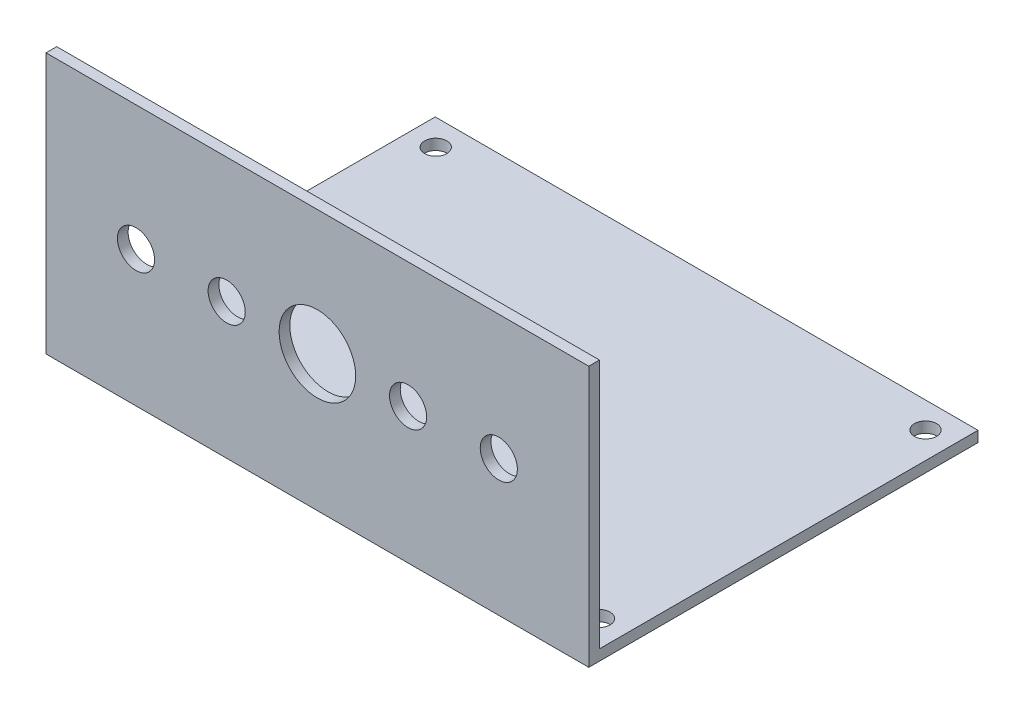
ISO-10303-21;
HEADER;
FILE_DESCRIPTION(('STEP AP214'),'2;1');
FILE_NAME('part.step','',(''),(''),'','','');
FILE_SCHEMA(('AUTOMOTIVE_DESIGN { 1 0 10303 214 1 1 1 1 }'));
ENDSEC;
DATA;
#1=APPLICATION_CONTEXT('core data for automotive mechanical design processes');
#2=APPLICATION_PROTOCOL_DEFINITION('international standard','automotive_design',2000,#1);
#3=PRODUCT_CONTEXT('',#1,'mechanical');
#4=PRODUCT('Part','Part','',(#3));
#5=PRODUCT_RELATED_PRODUCT_CATEGORY('part','',(#4));
#6=PRODUCT_DEFINITION_FORMATION('','',#4);
#7=PRODUCT_DEFINITION_CONTEXT('part definition',#1,'design');
#8=PRODUCT_DEFINITION('design','',#6,#7);
#9=PRODUCT_DEFINITION_SHAPE('','',#8);
#10=(LENGTH_UNIT() NAMED_UNIT(*) SI_UNIT(.MILLI.,.METRE.));
#11=(NAMED_UNIT(*) PLANE_ANGLE_UNIT() SI_UNIT($,.RADIAN.));
#12=(NAMED_UNIT(*) SI_UNIT($,.STERADIAN.) SOLID_ANGLE_UNIT());
#13=UNCERTAINTY_MEASURE_WITH_UNIT(LENGTH_MEASURE(1.E-05),#10,'distance_accuracy_value','');
#14=(GEOMETRIC_REPRESENTATION_CONTEXT(3) GLOBAL_UNCERTAINTY_ASSIGNED_CONTEXT((#13)) GLOBAL_UNIT_ASSIGNED_CONTEXT((#10,
#11,#12)) REPRESENTATION_CONTEXT('',''));
#15=CARTESIAN_POINT('',(0.,0.,0.));
#16=DIRECTION('',(0.,0.,1.));
#17=DIRECTION('',(1.,0.,0.));
#18=AXIS2_PLACEMENT_3D('',#15,#16,#17);
#19=CARTESIAN_POINT('',(0.,1.5,0.));
#20=DIRECTION('',(0.,1.,0.));
#21=DIRECTION('',(0.,0.,1.));
#22=AXIS2_PLACEMENT_3D('',#19,#20,#21);
#23=PLANE('',#22);
#24=DIRECTION('',(-1.,0.,0.));
#25=VECTOR('',#24,1.);
#26=CARTESIAN_POINT('',(-38.,1.5,26.5));
#27=LINE('',#26,#25);
#28=CARTESIAN_POINT('',(38.,1.5,26.5));
#29=VERTEX_POINT('',#28);
#30=CARTESIAN_POINT('',(-38.,1.5,26.5));
#31=VERTEX_POINT('',#30);
#32=EDGE_CURVE('E49',#29,#31,#27,.T.);
#33=ORIENTED_EDGE('',*,*,#32,.F.);
#34=DIRECTION('',(0.,0.,-1.));
#35=VECTOR('',#34,1.);
#36=CARTESIAN_POINT('',(38.,1.5,26.5));
#37=LINE('',#36,#35);
#38=CARTESIAN_POINT('',(38.,1.5,-26.5));
#39=VERTEX_POINT('',#38);
#40=EDGE_CURVE('E98',#29,#39,#37,.T.);
#41=ORIENTED_EDGE('',*,*,#40,.T.);
#42=DIRECTION('',(-1.,0.,0.));
#43=VECTOR('',#42,1.);
#44=CARTESIAN_POINT('',(38.,1.5,-26.5));
#45=LINE('',#44,#43);
#46=CARTESIAN_POINT('',(-38.,1.5,-26.5));
#47=VERTEX_POINT('',#46);
#48=EDGE_CURVE('E55',#39,#47,#45,.T.);
#49=ORIENTED_EDGE('',*,*,#48,.T.);
#50=DIRECTION('',(0.,0.,1.));
#51=VECTOR('',#50,1.);
#52=CARTESIAN_POINT('',(-38.,1.5,26.5));
#53=LINE('',#52,#51);
#54=EDGE_CURVE('E75',#47,#31,#53,.T.);
#55=ORIENTED_EDGE('',*,*,#54,.T.);
#56=EDGE_LOOP('',(#33,#41,#49,#55));
#57=FACE_BOUND('',#56,.T.);
#58=CARTESIAN_POINT('',(34.29,1.5,22.86));
#59=DIRECTION('',(0.,1.,0.));
#60=DIRECTION('',(0.,0.,1.));
#61=AXIS2_PLACEMENT_3D('',#58,#59,#60);
#62=CIRCLE('',#61,1.55);
#63=CARTESIAN_POINT('',(34.29,1.5,24.41));
#64=VERTEX_POINT('',#63);
#65=EDGE_CURVE('E107',#64,#64,#62,.T.);
#66=ORIENTED_EDGE('',*,*,#65,.F.);
#67=EDGE_LOOP('',(#66));
#68=FACE_BOUND('',#67,.T.);
#69=CARTESIAN_POINT('',(-34.29,1.5,-22.86));
#70=DIRECTION('',(0.,1.,0.));
#71=DIRECTION('',(0.,0.,1.));
#72=AXIS2_PLACEMENT_3D('',#69,#70,#71);
#73=CIRCLE('',#72,1.55);
#74=CARTESIAN_POINT('',(-34.29,1.5,-21.31));
#75=VERTEX_POINT('',#74);
#76=EDGE_CURVE('E90',#75,#75,#73,.T.);
#77=ORIENTED_EDGE('',*,*,#76,.F.);
#78=EDGE_LOOP('',(#77));
#79=FACE_BOUND('',#78,.T.);
#80=CARTESIAN_POINT('',(-34.29,1.5,22.86));
#81=DIRECTION('',(0.,1.,0.));
#82=DIRECTION('',(0.,0.,1.));
#83=AXIS2_PLACEMENT_3D('',#80,#81,#82);
#84=CIRCLE('',#83,1.55);
#85=CARTESIAN_POINT('',(-34.29,1.5,24.41));
#86=VERTEX_POINT('',#85);
#87=EDGE_CURVE('E102',#86,#86,#84,.T.);
#88=ORIENTED_EDGE('',*,*,#87,.F.);
#89=EDGE_LOOP('',(#88));
#90=FACE_BOUND('',#89,.T.);
#91=CARTESIAN_POINT('',(34.29,1.5,-22.86));
#92=DIRECTION('',(0.,1.,0.));
#93=DIRECTION('',(0.,0.,1.));
#94=AXIS2_PLACEMENT_3D('',#91,#92,#93);
#95=CIRCLE('',#94,1.55);
#96=CARTESIAN_POINT('',(34.29,1.5,-21.31));
#97=VERTEX_POINT('',#96);
#98=EDGE_CURVE('E113',#97,#97,#95,.T.);
#99=ORIENTED_EDGE('',*,*,#98,.F.);
#100=EDGE_LOOP('',(#99));
#101=FACE_BOUND('',#100,.T.);
#102=ADVANCED_FACE('F34',(#57,#68,#79,#90,#101),#23,.T.);
#103=CARTESIAN_POINT('',(0.,0.,0.));
#104=DIRECTION('',(0.,1.,0.));
#105=DIRECTION('',(0.,0.,1.));
#106=AXIS2_PLACEMENT_3D('',#103,#104,#105);
#107=PLANE('',#106);
#108=DIRECTION('',(0.,0.,1.));
#109=VECTOR('',#108,1.);
#110=CARTESIAN_POINT('',(-38.,0.,26.5));
#111=LINE('',#110,#109);
#112=CARTESIAN_POINT('',(-38.,0.,-26.5));
#113=VERTEX_POINT('',#112);
#114=CARTESIAN_POINT('',(-38.,0.,28.));
#115=VERTEX_POINT('',#114);
#116=EDGE_CURVE('E82',#113,#115,#111,.T.);
#117=ORIENTED_EDGE('',*,*,#116,.F.);
#118=DIRECTION('',(-1.,0.,0.));
#119=VECTOR('',#118,1.);
#120=CARTESIAN_POINT('',(38.,0.,-26.5));
#121=LINE('',#120,#119);
#122=CARTESIAN_POINT('',(38.,0.,-26.5));
#123=VERTEX_POINT('',#122);
#124=EDGE_CURVE('E67',#123,#113,#121,.T.);
#125=ORIENTED_EDGE('',*,*,#124,.F.);
#126=DIRECTION('',(0.,0.,-1.));
#127=VECTOR('',#126,1.);
#128=CARTESIAN_POINT('',(38.,0.,26.5));
#129=LINE('',#128,#127);
#130=CARTESIAN_POINT('',(38.,0.,28.));
#131=VERTEX_POINT('',#130);
#132=EDGE_CURVE('E76',#131,#123,#129,.T.);
#133=ORIENTED_EDGE('',*,*,#132,.F.);
#134=DIRECTION('',(1.,0.,0.));
#135=VECTOR('',#134,1.);
#136=CARTESIAN_POINT('',(-38.,0.,28.));
#137=LINE('',#136,#135);
#138=EDGE_CURVE('E88',#115,#131,#137,.T.);
#139=ORIENTED_EDGE('',*,*,#138,.F.);
#140=EDGE_LOOP('',(#117,#125,#133,#139));
#141=FACE_BOUND('',#140,.T.);
#142=CARTESIAN_POINT('',(-34.29,0.,-22.86));
#143=DIRECTION('',(0.,1.,0.));
#144=DIRECTION('',(0.,0.,1.));
#145=AXIS2_PLACEMENT_3D('',#142,#143,#144);
#146=CIRCLE('',#145,1.55);
#147=CARTESIAN_POINT('',(-34.29,0.,-21.31));
#148=VERTEX_POINT('',#147);
#149=EDGE_CURVE('E94',#148,#148,#146,.T.);
#150=ORIENTED_EDGE('',*,*,#149,.T.);
#151=EDGE_LOOP('',(#150));
#152=FACE_BOUND('',#151,.T.);
#153=CARTESIAN_POINT('',(-34.29,0.,22.86));
#154=DIRECTION('',(0.,1.,0.));
#155=DIRECTION('',(0.,0.,1.));
#156=AXIS2_PLACEMENT_3D('',#153,#154,#155);
#157=CIRCLE('',#156,1.55);
#158=CARTESIAN_POINT('',(-34.29,0.,24.41));
#159=VERTEX_POINT('',#158);
#160=EDGE_CURVE('E104',#159,#159,#157,.T.);
#161=ORIENTED_EDGE('',*,*,#160,.T.);
#162=EDGE_LOOP('',(#161));
#163=FACE_BOUND('',#162,.T.);
#164=CARTESIAN_POINT('',(34.29,0.,22.86));
#165=DIRECTION('',(0.,1.,0.));
#166=DIRECTION('',(0.,0.,1.));
#167=AXIS2_PLACEMENT_3D('',#164,#165,#166);
#168=CIRCLE('',#167,1.55);
#169=CARTESIAN_POINT('',(34.29,0.,24.41));
#170=VERTEX_POINT('',#169);
#171=EDGE_CURVE('E110',#170,#170,#168,.T.);
#172=ORIENTED_EDGE('',*,*,#171,.T.);
#173=EDGE_LOOP('',(#172));
#174=FACE_BOUND('',#173,.T.);
#175=CARTESIAN_POINT('',(34.29,0.,-22.86));
#176=DIRECTION('',(0.,1.,0.));
#177=DIRECTION('',(0.,0.,1.));
#178=AXIS2_PLACEMENT_3D('',#175,#176,#177);
#179=CIRCLE('',#178,1.55);
#180=CARTESIAN_POINT('',(34.29,0.,-21.31));
#181=VERTEX_POINT('',#180);
#182=EDGE_CURVE('E116',#181,#181,#179,.T.);
#183=ORIENTED_EDGE('',*,*,#182,.T.);
#184=EDGE_LOOP('',(#183));
#185=FACE_BOUND('',#184,.T.);
#186=ADVANCED_FACE('F85',(#141,#152,#163,#174,#185),#107,.F.);
#187=CARTESIAN_POINT('',(-38.,1.5,26.5));
#188=DIRECTION('',(1.,0.,0.));
#189=DIRECTION('',(0.,0.,-1.));
#190=AXIS2_PLACEMENT_3D('',#187,#188,#189);
#191=PLANE('',#190);
#192=ORIENTED_EDGE('',*,*,#116,.T.);
#193=DIRECTION('',(0.,-1.,0.));
#194=VECTOR('',#193,1.);
#195=CARTESIAN_POINT('',(-38.,1.5,28.));
#196=LINE('',#195,#194);
#197=CARTESIAN_POINT('',(-38.,36.52,28.));
#198=VERTEX_POINT('',#197);
#199=EDGE_CURVE('E125',#198,#115,#196,.T.);
#200=ORIENTED_EDGE('',*,*,#199,.F.);
#201=DIRECTION('',(0.,0.,1.));
#202=VECTOR('',#201,1.);
#203=CARTESIAN_POINT('',(-38.,36.52,28.));
#204=LINE('',#203,#202);
#205=CARTESIAN_POINT('',(-38.,36.52,26.5));
#206=VERTEX_POINT('',#205);
#207=EDGE_CURVE('E134',#206,#198,#204,.T.);
#208=ORIENTED_EDGE('',*,*,#207,.F.);
#209=DIRECTION('',(0.,-1.,0.));
#210=VECTOR('',#209,1.);
#211=CARTESIAN_POINT('',(-38.,36.52,26.5));
#212=LINE('',#211,#210);
#213=EDGE_CURVE('E130',#206,#31,#212,.T.);
#214=ORIENTED_EDGE('',*,*,#213,.T.);
#215=ORIENTED_EDGE('',*,*,#54,.F.);
#216=DIRECTION('',(0.,-1.,0.));
#217=VECTOR('',#216,1.);
#218=CARTESIAN_POINT('',(-38.,1.5,-26.5));
#219=LINE('',#218,#217);
#220=EDGE_CURVE('E42',#47,#113,#219,.T.);
#221=ORIENTED_EDGE('',*,*,#220,.T.);
#222=EDGE_LOOP('',(#192,#200,#208,#214,#215,#221));
#223=FACE_BOUND('',#222,.T.);
#224=ADVANCED_FACE('F36',(#223),#191,.F.);
#225=CARTESIAN_POINT('',(38.,1.5,26.5));
#226=DIRECTION('',(-1.,0.,0.));
#227=DIRECTION('',(0.,0.,1.));
#228=AXIS2_PLACEMENT_3D('',#225,#226,#227);
#229=PLANE('',#228);
#230=ORIENTED_EDGE('',*,*,#132,.T.);
#231=DIRECTION('',(0.,-1.,0.));
#232=VECTOR('',#231,1.);
#233=CARTESIAN_POINT('',(38.,1.5,-26.5));
#234=LINE('',#233,#232);
#235=EDGE_CURVE('E11',#39,#123,#234,.T.);
#236=ORIENTED_EDGE('',*,*,#235,.F.);
#237=ORIENTED_EDGE('',*,*,#40,.F.);
#238=DIRECTION('',(0.,-1.,0.));
#239=VECTOR('',#238,1.);
#240=CARTESIAN_POINT('',(38.,36.52,26.5));
#241=LINE('',#240,#239);
#242=CARTESIAN_POINT('',(38.,36.52,26.5));
#243=VERTEX_POINT('',#242);
#244=EDGE_CURVE('E127',#243,#29,#241,.T.);
#245=ORIENTED_EDGE('',*,*,#244,.F.);
#246=DIRECTION('',(0.,0.,-1.));
#247=VECTOR('',#246,1.);
#248=CARTESIAN_POINT('',(38.,36.52,28.));
#249=LINE('',#248,#247);
#250=CARTESIAN_POINT('',(38.,36.52,28.));
#251=VERTEX_POINT('',#250);
#252=EDGE_CURVE('E138',#251,#243,#249,.T.);
#253=ORIENTED_EDGE('',*,*,#252,.F.);
#254=DIRECTION('',(0.,-1.,0.));
#255=VECTOR('',#254,1.);
#256=CARTESIAN_POINT('',(38.,1.5,28.));
#257=LINE('',#256,#255);
#258=EDGE_CURVE('E119',#251,#131,#257,.T.);
#259=ORIENTED_EDGE('',*,*,#258,.T.);
#260=EDGE_LOOP('',(#230,#236,#237,#245,#253,#259));
#261=FACE_BOUND('',#260,.T.);
#262=ADVANCED_FACE('F208',(#261),#229,.F.);
#263=CARTESIAN_POINT('',(38.,1.5,-26.5));
#264=DIRECTION('',(0.,0.,1.));
#265=DIRECTION('',(1.,0.,0.));
#266=AXIS2_PLACEMENT_3D('',#263,#264,#265);
#267=PLANE('',#266);
#268=ORIENTED_EDGE('',*,*,#124,.T.);
#269=ORIENTED_EDGE('',*,*,#220,.F.);
#270=ORIENTED_EDGE('',*,*,#48,.F.);
#271=ORIENTED_EDGE('',*,*,#235,.T.);
#272=EDGE_LOOP('',(#268,#269,#270,#271));
#273=FACE_BOUND('',#272,.T.);
#274=ADVANCED_FACE('F69',(#273),#267,.F.);
#275=CARTESIAN_POINT('',(-34.29,1.5,-22.86));
#276=DIRECTION('',(0.,-1.,0.));
#277=DIRECTION('',(0.,0.,-1.));
#278=AXIS2_PLACEMENT_3D('',#275,#276,#277);
#279=CYLINDRICAL_SURFACE('',#278,1.55);
#280=ORIENTED_EDGE('',*,*,#76,.T.);
#281=EDGE_LOOP('',(#280));
#282=FACE_BOUND('',#281,.T.);
#283=ORIENTED_EDGE('',*,*,#149,.F.);
#284=EDGE_LOOP('',(#283));
#285=FACE_BOUND('',#284,.T.);
#286=ADVANCED_FACE('F235',(#282,#285),#279,.F.);
#287=CARTESIAN_POINT('',(-34.29,1.5,22.86));
#288=DIRECTION('',(0.,-1.,0.));
#289=DIRECTION('',(0.,0.,-1.));
#290=AXIS2_PLACEMENT_3D('',#287,#288,#289);
#291=CYLINDRICAL_SURFACE('',#290,1.55);
#292=ORIENTED_EDGE('',*,*,#87,.T.);
#293=EDGE_LOOP('',(#292));
#294=FACE_BOUND('',#293,.T.);
#295=ORIENTED_EDGE('',*,*,#160,.F.);
#296=EDGE_LOOP('',(#295));
#297=FACE_BOUND('',#296,.T.);
#298=ADVANCED_FACE('F252',(#294,#297),#291,.F.);
#299=CARTESIAN_POINT('',(34.29,1.5,22.86));
#300=DIRECTION('',(0.,-1.,0.));
#301=DIRECTION('',(0.,0.,-1.));
#302=AXIS2_PLACEMENT_3D('',#299,#300,#301);
#303=CYLINDRICAL_SURFACE('',#302,1.55);
#304=ORIENTED_EDGE('',*,*,#65,.T.);
#305=EDGE_LOOP('',(#304));
#306=FACE_BOUND('',#305,.T.);
#307=ORIENTED_EDGE('',*,*,#171,.F.);
#308=EDGE_LOOP('',(#307));
#309=FACE_BOUND('',#308,.T.);
#310=ADVANCED_FACE('F223',(#306,#309),#303,.F.);
#311=CARTESIAN_POINT('',(34.29,1.5,-22.86));
#312=DIRECTION('',(0.,-1.,0.));
#313=DIRECTION('',(0.,0.,-1.));
#314=AXIS2_PLACEMENT_3D('',#311,#312,#313);
#315=CYLINDRICAL_SURFACE('',#314,1.55);
#316=ORIENTED_EDGE('',*,*,#98,.T.);
#317=EDGE_LOOP('',(#316));
#318=FACE_BOUND('',#317,.T.);
#319=ORIENTED_EDGE('',*,*,#182,.F.);
#320=EDGE_LOOP('',(#319));
#321=FACE_BOUND('',#320,.T.);
#322=ADVANCED_FACE('F220',(#318,#321),#315,.F.);
#323=CARTESIAN_POINT('',(0.,0.,28.));
#324=DIRECTION('',(0.,0.,1.));
#325=DIRECTION('',(1.,0.,0.));
#326=AXIS2_PLACEMENT_3D('',#323,#324,#325);
#327=PLANE('',#326);
#328=CARTESIAN_POINT('',(-25.4,19.02,28.));
#329=DIRECTION('',(0.,0.,1.));
#330=DIRECTION('',(1.,0.,0.));
#331=AXIS2_PLACEMENT_3D('',#328,#329,#330);
#332=CIRCLE('',#331,2.600000007);
#333=CARTESIAN_POINT('',(-22.799999993,19.02,28.));
#334=VERTEX_POINT('',#333);
#335=EDGE_CURVE('E135',#334,#334,#332,.T.);
#336=ORIENTED_EDGE('',*,*,#335,.F.);
#337=EDGE_LOOP('',(#336));
#338=FACE_BOUND('',#337,.T.);
#339=CARTESIAN_POINT('',(-12.7,19.02,28.));
#340=DIRECTION('',(0.,0.,1.));
#341=DIRECTION('',(1.,0.,0.));
#342=AXIS2_PLACEMENT_3D('',#339,#340,#341);
#343=CIRCLE('',#342,2.600000007);
#344=CARTESIAN_POINT('',(-10.099999993,19.02,28.));
#345=VERTEX_POINT('',#344);
#346=EDGE_CURVE('E148',#345,#345,#343,.T.);
#347=ORIENTED_EDGE('',*,*,#346,.F.);
#348=EDGE_LOOP('',(#347));
#349=FACE_BOUND('',#348,.T.);
#350=CARTESIAN_POINT('',(25.4,19.02,28.));
#351=DIRECTION('',(0.,0.,1.));
#352=DIRECTION('',(1.,0.,0.));
#353=AXIS2_PLACEMENT_3D('',#350,#351,#352);
#354=CIRCLE('',#353,2.600000007);
#355=CARTESIAN_POINT('',(28.000000007,19.02,28.));
#356=VERTEX_POINT('',#355);
#357=EDGE_CURVE('E151',#356,#356,#354,.T.);
#358=ORIENTED_EDGE('',*,*,#357,.F.);
#359=EDGE_LOOP('',(#358));
#360=FACE_BOUND('',#359,.T.);
#361=CARTESIAN_POINT('',(12.7,19.02,28.));
#362=DIRECTION('',(0.,0.,1.));
#363=DIRECTION('',(1.,0.,0.));
#364=AXIS2_PLACEMENT_3D('',#361,#362,#363);
#365=CIRCLE('',#364,2.600000007);
#366=CARTESIAN_POINT('',(15.300000007,19.02,28.));
#367=VERTEX_POINT('',#366);
#368=EDGE_CURVE('E154',#367,#367,#365,.T.);
#369=ORIENTED_EDGE('',*,*,#368,.F.);
#370=EDGE_LOOP('',(#369));
#371=FACE_BOUND('',#370,.T.);
#372=CARTESIAN_POINT('',(0.,19.02,28.));
#373=DIRECTION('',(0.,0.,1.));
#374=DIRECTION('',(1.,0.,0.));
#375=AXIS2_PLACEMENT_3D('',#372,#373,#374);
#376=CIRCLE('',#375,5.36);
#377=CARTESIAN_POINT('',(5.36,19.02,28.));
#378=VERTEX_POINT('',#377);
#379=EDGE_CURVE('E157',#378,#378,#376,.T.);
#380=ORIENTED_EDGE('',*,*,#379,.F.);
#381=EDGE_LOOP('',(#380));
#382=FACE_BOUND('',#381,.T.);
#383=ORIENTED_EDGE('',*,*,#199,.T.);
#384=ORIENTED_EDGE('',*,*,#138,.T.);
#385=ORIENTED_EDGE('',*,*,#258,.F.);
#386=DIRECTION('',(1.,0.,0.));
#387=VECTOR('',#386,1.);
#388=CARTESIAN_POINT('',(-38.,36.52,28.));
#389=LINE('',#388,#387);
#390=EDGE_CURVE('E141',#198,#251,#389,.T.);
#391=ORIENTED_EDGE('',*,*,#390,.F.);
#392=EDGE_LOOP('',(#383,#384,#385,#391));
#393=FACE_BOUND('',#392,.T.);
#394=ADVANCED_FACE('F182',(#338,#349,#360,#371,#382,#393),#327,.T.);
#395=CARTESIAN_POINT('',(-38.,36.52,26.5));
#396=DIRECTION('',(0.,0.,1.));
#397=DIRECTION('',(1.,0.,0.));
#398=AXIS2_PLACEMENT_3D('',#395,#396,#397);
#399=PLANE('',#398);
#400=CARTESIAN_POINT('',(-25.4,19.02,26.5));
#401=DIRECTION('',(0.,0.,-1.));
#402=DIRECTION('',(-1.,0.,0.));
#403=AXIS2_PLACEMENT_3D('',#400,#401,#402);
#404=CIRCLE('',#403,2.600000007);
#405=CARTESIAN_POINT('',(-28.000000007,19.02,26.5));
#406=VERTEX_POINT('',#405);
#407=EDGE_CURVE('E164',#406,#406,#404,.T.);
#408=ORIENTED_EDGE('',*,*,#407,.F.);
#409=EDGE_LOOP('',(#408));
#410=FACE_BOUND('',#409,.T.);
#411=CARTESIAN_POINT('',(-12.7,19.02,26.5));
#412=DIRECTION('',(0.,0.,-1.));
#413=DIRECTION('',(-1.,0.,0.));
#414=AXIS2_PLACEMENT_3D('',#411,#412,#413);
#415=CIRCLE('',#414,2.600000007);
#416=CARTESIAN_POINT('',(-15.300000007,19.02,26.5));
#417=VERTEX_POINT('',#416);
#418=EDGE_CURVE('E167',#417,#417,#415,.T.);
#419=ORIENTED_EDGE('',*,*,#418,.F.);
#420=EDGE_LOOP('',(#419));
#421=FACE_BOUND('',#420,.T.);
#422=CARTESIAN_POINT('',(25.4,19.02,26.5));
#423=DIRECTION('',(0.,0.,-1.));
#424=DIRECTION('',(-1.,0.,0.));
#425=AXIS2_PLACEMENT_3D('',#422,#423,#424);
#426=CIRCLE('',#425,2.600000007);
#427=CARTESIAN_POINT('',(22.799999993,19.02,26.5));
#428=VERTEX_POINT('',#427);
#429=EDGE_CURVE('E170',#428,#428,#426,.T.);
#430=ORIENTED_EDGE('',*,*,#429,.F.);
#431=EDGE_LOOP('',(#430));
#432=FACE_BOUND('',#431,.T.);
#433=CARTESIAN_POINT('',(12.7,19.02,26.5));
#434=DIRECTION('',(0.,0.,-1.));
#435=DIRECTION('',(-1.,0.,0.));
#436=AXIS2_PLACEMENT_3D('',#433,#434,#435);
#437=CIRCLE('',#436,2.600000007);
#438=CARTESIAN_POINT('',(10.099999993,19.02,26.5));
#439=VERTEX_POINT('',#438);
#440=EDGE_CURVE('E163',#439,#439,#437,.T.);
#441=ORIENTED_EDGE('',*,*,#440,.F.);
#442=EDGE_LOOP('',(#441));
#443=FACE_BOUND('',#442,.T.);
#444=CARTESIAN_POINT('',(0.,19.02,26.5));
#445=DIRECTION('',(0.,0.,-1.));
#446=DIRECTION('',(-1.,0.,0.));
#447=AXIS2_PLACEMENT_3D('',#444,#445,#446);
#448=CIRCLE('',#447,5.36);
#449=CARTESIAN_POINT('',(-5.36,19.02,26.5));
#450=VERTEX_POINT('',#449);
#451=EDGE_CURVE('E160',#450,#450,#448,.T.);
#452=ORIENTED_EDGE('',*,*,#451,.F.);
#453=EDGE_LOOP('',(#452));
#454=FACE_BOUND('',#453,.T.);
#455=ORIENTED_EDGE('',*,*,#32,.T.);
#456=ORIENTED_EDGE('',*,*,#213,.F.);
#457=DIRECTION('',(-1.,0.,0.));
#458=VECTOR('',#457,1.);
#459=CARTESIAN_POINT('',(-38.,36.52,26.5));
#460=LINE('',#459,#458);
#461=EDGE_CURVE('E132',#243,#206,#460,.T.);
#462=ORIENTED_EDGE('',*,*,#461,.F.);
#463=ORIENTED_EDGE('',*,*,#244,.T.);
#464=EDGE_LOOP('',(#455,#456,#462,#463));
#465=FACE_BOUND('',#464,.T.);
#466=ADVANCED_FACE('F178',(#410,#421,#432,#443,#454,#465),#399,.F.);
#467=CARTESIAN_POINT('',(0.,36.52,0.));
#468=DIRECTION('',(0.,-1.,0.));
#469=DIRECTION('',(0.,0.,-1.));
#470=AXIS2_PLACEMENT_3D('',#467,#468,#469);
#471=PLANE('',#470);
#472=ORIENTED_EDGE('',*,*,#207,.T.);
#473=ORIENTED_EDGE('',*,*,#390,.T.);
#474=ORIENTED_EDGE('',*,*,#252,.T.);
#475=ORIENTED_EDGE('',*,*,#461,.T.);
#476=EDGE_LOOP('',(#472,#473,#474,#475));
#477=FACE_BOUND('',#476,.T.);
#478=ADVANCED_FACE('F181',(#477),#471,.F.);
#479=CARTESIAN_POINT('',(0.,19.02,86.5));
#480=DIRECTION('',(0.,0.,-1.));
#481=DIRECTION('',(-1.,0.,0.));
#482=AXIS2_PLACEMENT_3D('',#479,#480,#481);
#483=CYLINDRICAL_SURFACE('',#482,5.36);
#484=ORIENTED_EDGE('',*,*,#379,.T.);
#485=EDGE_LOOP('',(#484));
#486=FACE_BOUND('',#485,.T.);
#487=ORIENTED_EDGE('',*,*,#451,.T.);
#488=EDGE_LOOP('',(#487));
#489=FACE_BOUND('',#488,.T.);
#490=ADVANCED_FACE('F288',(#486,#489),#483,.F.);
#491=CARTESIAN_POINT('',(12.7,19.02,86.5));
#492=DIRECTION('',(0.,0.,-1.));
#493=DIRECTION('',(-1.,0.,0.));
#494=AXIS2_PLACEMENT_3D('',#491,#492,#493);
#495=CYLINDRICAL_SURFACE('',#494,2.600000007);
#496=ORIENTED_EDGE('',*,*,#368,.T.);
#497=EDGE_LOOP('',(#496));
#498=FACE_BOUND('',#497,.T.);
#499=ORIENTED_EDGE('',*,*,#440,.T.);
#500=EDGE_LOOP('',(#499));
#501=FACE_BOUND('',#500,.T.);
#502=ADVANCED_FACE('F176',(#498,#501),#495,.F.);
#503=CARTESIAN_POINT('',(25.4,19.02,86.5));
#504=DIRECTION('',(0.,0.,-1.));
#505=DIRECTION('',(-1.,0.,0.));
#506=AXIS2_PLACEMENT_3D('',#503,#504,#505);
#507=CYLINDRICAL_SURFACE('',#506,2.600000007);
#508=ORIENTED_EDGE('',*,*,#357,.T.);
#509=EDGE_LOOP('',(#508));
#510=FACE_BOUND('',#509,.T.);
#511=ORIENTED_EDGE('',*,*,#429,.T.);
#512=EDGE_LOOP('',(#511));
#513=FACE_BOUND('',#512,.T.);
#514=ADVANCED_FACE('F301',(#510,#513),#507,.F.);
#515=CARTESIAN_POINT('',(-12.7,19.02,86.5));
#516=DIRECTION('',(0.,0.,-1.));
#517=DIRECTION('',(-1.,0.,0.));
#518=AXIS2_PLACEMENT_3D('',#515,#516,#517);
#519=CYLINDRICAL_SURFACE('',#518,2.600000007);
#520=ORIENTED_EDGE('',*,*,#346,.T.);
#521=EDGE_LOOP('',(#520));
#522=FACE_BOUND('',#521,.T.);
#523=ORIENTED_EDGE('',*,*,#418,.T.);
#524=EDGE_LOOP('',(#523));
#525=FACE_BOUND('',#524,.T.);
#526=ADVANCED_FACE('F309',(#522,#525),#519,.F.);
#527=CARTESIAN_POINT('',(-25.4,19.02,86.5));
#528=DIRECTION('',(0.,0.,-1.));
#529=DIRECTION('',(-1.,0.,0.));
#530=AXIS2_PLACEMENT_3D('',#527,#528,#529);
#531=CYLINDRICAL_SURFACE('',#530,2.600000007);
#532=ORIENTED_EDGE('',*,*,#335,.T.);
#533=EDGE_LOOP('',(#532));
#534=FACE_BOUND('',#533,.T.);
#535=ORIENTED_EDGE('',*,*,#407,.T.);
#536=EDGE_LOOP('',(#535));
#537=FACE_BOUND('',#536,.T.);
#538=ADVANCED_FACE('F317',(#534,#537),#531,.F.);
#539=CLOSED_SHELL('',(#102,#186,#224,#262,#274,#286,#298,#310,#322,#394,#466,#478,#490,#502,
#514,#526,#538));
#540=MANIFOLD_SOLID_BREP('B2',#539);
#541=ADVANCED_BREP_SHAPE_REPRESENTATION('',(#18,#540),#14);
#542=SHAPE_DEFINITION_REPRESENTATION(#9,#541);
ENDSEC;
END-ISO-10303-21;
